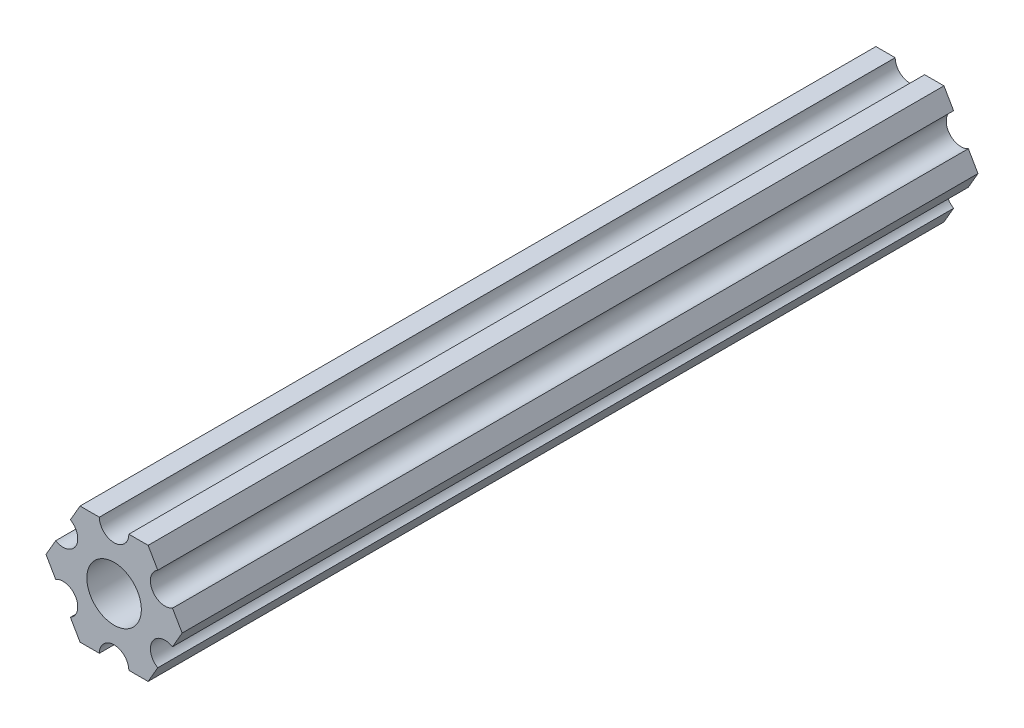
ISO-10303-21;
HEADER;
FILE_DESCRIPTION(('STEP AP214'),'2;1');
FILE_NAME('part.step','',(''),(''),'','','');
FILE_SCHEMA(('AUTOMOTIVE_DESIGN { 1 0 10303 214 1 1 1 1 }'));
ENDSEC;
DATA;
#1=APPLICATION_CONTEXT('core data for automotive mechanical design processes');
#2=APPLICATION_PROTOCOL_DEFINITION('international standard','automotive_design',2000,#1);
#3=PRODUCT_CONTEXT('',#1,'mechanical');
#4=PRODUCT('Part','Part','',(#3));
#5=PRODUCT_RELATED_PRODUCT_CATEGORY('part','',(#4));
#6=PRODUCT_DEFINITION_FORMATION('','',#4);
#7=PRODUCT_DEFINITION_CONTEXT('part definition',#1,'design');
#8=PRODUCT_DEFINITION('design','',#6,#7);
#9=PRODUCT_DEFINITION_SHAPE('','',#8);
#10=(LENGTH_UNIT() NAMED_UNIT(*) SI_UNIT(.MILLI.,.METRE.));
#11=(NAMED_UNIT(*) PLANE_ANGLE_UNIT() SI_UNIT($,.RADIAN.));
#12=(NAMED_UNIT(*) SI_UNIT($,.STERADIAN.) SOLID_ANGLE_UNIT());
#13=UNCERTAINTY_MEASURE_WITH_UNIT(LENGTH_MEASURE(1.E-05),#10,'distance_accuracy_value','');
#14=(GEOMETRIC_REPRESENTATION_CONTEXT(3) GLOBAL_UNCERTAINTY_ASSIGNED_CONTEXT((#13)) GLOBAL_UNIT_ASSIGNED_CONTEXT((#10,
#11,#12)) REPRESENTATION_CONTEXT('',''));
#15=CARTESIAN_POINT('',(0.,0.,0.));
#16=DIRECTION('',(0.,0.,1.));
#17=DIRECTION('',(1.,0.,0.));
#18=AXIS2_PLACEMENT_3D('',#15,#16,#17);
#19=CARTESIAN_POINT('',(6.29301142309098,-1.80018429024546,85.725));
#20=DIRECTION('',(-0.866025434075723,0.499999947533953,0.));
#21=DIRECTION('',(-0.499999947533953,-0.866025434075723,0.));
#22=AXIS2_PLACEMENT_3D('',#19,#20,#21);
#23=PLANE('',#22);
#24=DIRECTION('',(0.,0.,1.));
#25=VECTOR('',#24,1.);
#26=CARTESIAN_POINT('',(7.33234841870826,4.44212519169686E-07,85.725));
#27=LINE('',#26,#25);
#28=CARTESIAN_POINT('',(7.33234841870826,4.44212518961143E-07,0.));
#29=VERTEX_POINT('',#28);
#30=CARTESIAN_POINT('',(7.33234841870826,4.44212519315656E-07,85.725));
#31=VERTEX_POINT('',#30);
#32=EDGE_CURVE('E322',#29,#31,#27,.T.);
#33=ORIENTED_EDGE('',*,*,#32,.T.);
#34=DIRECTION('',(0.499999947533953,0.866025434075723,0.));
#35=VECTOR('',#34,1.);
#36=CARTESIAN_POINT('',(6.29301142309098,-1.80018429024546,85.725));
#37=LINE('',#36,#35);
#38=CARTESIAN_POINT('',(6.29301142309098,-1.80018429024546,85.725));
#39=VERTEX_POINT('',#38);
#40=EDGE_CURVE('E214',#39,#31,#37,.T.);
#41=ORIENTED_EDGE('',*,*,#40,.F.);
#42=DIRECTION('',(0.,0.,-1.));
#43=VECTOR('',#42,1.);
#44=CARTESIAN_POINT('',(6.29301142309098,-1.80018429024546,85.725));
#45=LINE('',#44,#43);
#46=CARTESIAN_POINT('',(6.29301142309098,-1.80018429024546,0.));
#47=VERTEX_POINT('',#46);
#48=EDGE_CURVE('E267',#39,#47,#45,.T.);
#49=ORIENTED_EDGE('',*,*,#48,.T.);
#50=DIRECTION('',(0.499999947533953,0.866025434075723,0.));
#51=VECTOR('',#50,1.);
#52=CARTESIAN_POINT('',(6.29301142309098,-1.80018429024546,0.));
#53=LINE('',#52,#51);
#54=EDGE_CURVE('E217',#47,#29,#53,.T.);
#55=ORIENTED_EDGE('',*,*,#54,.T.);
#56=EDGE_LOOP('',(#33,#41,#49,#55));
#57=FACE_BOUND('',#56,.T.);
#58=ADVANCED_FACE('F16',(#57),#23,.F.);
#59=CARTESIAN_POINT('',(7.33234841870826,4.44212519169686E-07,85.725));
#60=DIRECTION('',(-0.866025373493145,-0.500000052466056,0.));
#61=DIRECTION('',(0.500000052466056,-0.866025373493145,0.));
#62=AXIS2_PLACEMENT_3D('',#59,#60,#61);
#63=PLANE('',#62);
#64=DIRECTION('',(0.,0.,-1.));
#65=VECTOR('',#64,1.);
#66=CARTESIAN_POINT('',(6.29301120497139,1.80018505273895,85.725));
#67=LINE('',#66,#65);
#68=CARTESIAN_POINT('',(6.29301120497139,1.80018505273895,0.));
#69=VERTEX_POINT('',#68);
#70=CARTESIAN_POINT('',(6.29301120497139,1.80018505273895,85.725));
#71=VERTEX_POINT('',#70);
#72=EDGE_CURVE('E319',#69,#71,#67,.F.);
#73=ORIENTED_EDGE('',*,*,#72,.T.);
#74=DIRECTION('',(-0.500000052466056,0.866025373493145,0.));
#75=VECTOR('',#74,1.);
#76=CARTESIAN_POINT('',(7.33234841870826,4.44212519198905E-07,85.725));
#77=LINE('',#76,#75);
#78=EDGE_CURVE('E74',#31,#71,#77,.T.);
#79=ORIENTED_EDGE('',*,*,#78,.F.);
#80=ORIENTED_EDGE('',*,*,#32,.F.);
#81=DIRECTION('',(-0.500000052466056,0.866025373493145,0.));
#82=VECTOR('',#81,1.);
#83=CARTESIAN_POINT('',(7.33234841870826,4.44212519198905E-07,0.));
#84=LINE('',#83,#82);
#85=EDGE_CURVE('E263',#29,#69,#84,.T.);
#86=ORIENTED_EDGE('',*,*,#85,.T.);
#87=EDGE_LOOP('',(#73,#79,#80,#86));
#88=FACE_BOUND('',#87,.T.);
#89=ADVANCED_FACE('F380',(#88),#63,.F.);
#90=CARTESIAN_POINT('',(5.49926112168156,3.17500033315933,85.725));
#91=DIRECTION('',(0.,0.,-1.));
#92=DIRECTION('',(-1.,0.,0.));
#93=AXIS2_PLACEMENT_3D('',#90,#91,#92);
#94=CYLINDRICAL_SURFACE('',#93,1.5875);
#95=CARTESIAN_POINT('',(5.49926112168156,3.17500033315933,85.725));
#96=DIRECTION('',(0.,0.,-1.));
#97=DIRECTION('',(-1.,0.,0.));
#98=AXIS2_PLACEMENT_3D('',#95,#96,#97);
#99=CIRCLE('',#98,1.5875);
#100=CARTESIAN_POINT('',(4.70551103839172,4.54981561357972,85.725));
#101=VERTEX_POINT('',#100);
#102=EDGE_CURVE('E65',#71,#101,#99,.T.);
#103=ORIENTED_EDGE('',*,*,#102,.F.);
#104=ORIENTED_EDGE('',*,*,#72,.F.);
#105=CARTESIAN_POINT('',(5.49926112168156,3.17500033315933,0.));
#106=DIRECTION('',(0.,0.,-1.));
#107=DIRECTION('',(-1.,0.,0.));
#108=AXIS2_PLACEMENT_3D('',#105,#106,#107);
#109=CIRCLE('',#108,1.5875);
#110=CARTESIAN_POINT('',(4.70551103839172,4.54981561357972,0.));
#111=VERTEX_POINT('',#110);
#112=EDGE_CURVE('E19',#69,#111,#109,.T.);
#113=ORIENTED_EDGE('',*,*,#112,.T.);
#114=DIRECTION('',(0.,0.,1.));
#115=VECTOR('',#114,1.);
#116=CARTESIAN_POINT('',(4.70551103839172,4.54981561357972,85.725));
#117=LINE('',#116,#115);
#118=EDGE_CURVE('E316',#111,#101,#117,.T.);
#119=ORIENTED_EDGE('',*,*,#118,.T.);
#120=EDGE_LOOP('',(#103,#104,#113,#119));
#121=FACE_BOUND('',#120,.T.);
#122=ADVANCED_FACE('F378',(#121),#94,.F.);
#123=CARTESIAN_POINT('',(4.70551103839172,4.54981561357972,85.725));
#124=DIRECTION('',(-0.866025373493151,-0.500000052466046,0.));
#125=DIRECTION('',(0.500000052466046,-0.866025373493151,0.));
#126=AXIS2_PLACEMENT_3D('',#123,#124,#125);
#127=PLANE('',#126);
#128=DIRECTION('',(0.,0.,1.));
#129=VECTOR('',#128,1.);
#130=CARTESIAN_POINT('',(3.66617382465481,6.35000022210627,85.725));
#131=LINE('',#130,#129);
#132=CARTESIAN_POINT('',(3.66617382465481,6.35000022210627,0.));
#133=VERTEX_POINT('',#132);
#134=CARTESIAN_POINT('',(3.66617382465481,6.35000022210627,85.725));
#135=VERTEX_POINT('',#134);
#136=EDGE_CURVE('E312',#133,#135,#131,.T.);
#137=ORIENTED_EDGE('',*,*,#136,.T.);
#138=DIRECTION('',(-0.500000052466046,0.866025373493151,0.));
#139=VECTOR('',#138,1.);
#140=CARTESIAN_POINT('',(4.70551103839172,4.54981561357972,85.725));
#141=LINE('',#140,#139);
#142=EDGE_CURVE('E209',#101,#135,#141,.T.);
#143=ORIENTED_EDGE('',*,*,#142,.F.);
#144=ORIENTED_EDGE('',*,*,#118,.F.);
#145=DIRECTION('',(-0.500000052466046,0.866025373493151,0.));
#146=VECTOR('',#145,1.);
#147=CARTESIAN_POINT('',(4.70551103839172,4.54981561357972,0.));
#148=LINE('',#147,#146);
#149=EDGE_CURVE('E259',#111,#133,#148,.T.);
#150=ORIENTED_EDGE('',*,*,#149,.T.);
#151=EDGE_LOOP('',(#137,#143,#144,#150));
#152=FACE_BOUND('',#151,.T.);
#153=ADVANCED_FACE('F369',(#152),#127,.F.);
#154=CARTESIAN_POINT('',(3.66617382465481,6.35000022210627,85.725));
#155=DIRECTION('',(6.05825850611185E-08,-0.999999999999998,0.));
#156=DIRECTION('',(0.999999999999998,6.05825850611185E-08,0.));
#157=AXIS2_PLACEMENT_3D('',#154,#155,#156);
#158=PLANE('',#157);
#159=DIRECTION('',(0.,0.,-1.));
#160=VECTOR('',#159,1.);
#161=CARTESIAN_POINT('',(1.58749961530074,6.35000009617482,85.725));
#162=LINE('',#161,#160);
#163=CARTESIAN_POINT('',(1.58749961530073,6.35000015914054,0.));
#164=VERTEX_POINT('',#163);
#165=CARTESIAN_POINT('',(1.58749961530073,6.35000015914054,85.725));
#166=VERTEX_POINT('',#165);
#167=EDGE_CURVE('E309',#164,#166,#162,.F.);
#168=ORIENTED_EDGE('',*,*,#167,.T.);
#169=DIRECTION('',(1.,0.,0.));
#170=VECTOR('',#169,1.);
#171=CARTESIAN_POINT('',(5.49926112168156,6.35000022210627,85.725));
#172=LINE('',#171,#170);
#173=EDGE_CURVE('E174',#135,#166,#172,.F.);
#174=ORIENTED_EDGE('',*,*,#173,.F.);
#175=ORIENTED_EDGE('',*,*,#136,.F.);
#176=DIRECTION('',(1.,0.,0.));
#177=VECTOR('',#176,1.);
#178=CARTESIAN_POINT('',(5.49926112168156,6.35000022210627,0.));
#179=LINE('',#178,#177);
#180=EDGE_CURVE('E255',#133,#164,#179,.F.);
#181=ORIENTED_EDGE('',*,*,#180,.T.);
#182=EDGE_LOOP('',(#168,#174,#175,#181));
#183=FACE_BOUND('',#182,.T.);
#184=ADVANCED_FACE('F366',(#183),#158,.F.);
#185=CARTESIAN_POINT('',(-3.84699260060323E-07,6.35,85.725));
#186=DIRECTION('',(0.,0.,-1.));
#187=DIRECTION('',(-1.,0.,0.));
#188=AXIS2_PLACEMENT_3D('',#185,#186,#187);
#189=CYLINDRICAL_SURFACE('',#188,1.5875);
#190=DIRECTION('',(0.,0.,1.));
#191=VECTOR('',#190,1.);
#192=CARTESIAN_POINT('',(-1.58750038469926,6.34999990382518,85.725));
#193=LINE('',#192,#191);
#194=CARTESIAN_POINT('',(-1.58750038469926,6.34999990382518,0.));
#195=VERTEX_POINT('',#194);
#196=CARTESIAN_POINT('',(-1.58750038469926,6.34999990382518,85.725));
#197=VERTEX_POINT('',#196);
#198=EDGE_CURVE('E124',#195,#197,#193,.T.);
#199=ORIENTED_EDGE('',*,*,#198,.T.);
#200=CARTESIAN_POINT('',(-3.84699260060323E-07,6.35,85.725));
#201=DIRECTION('',(0.,0.,-1.));
#202=DIRECTION('',(-1.,0.,0.));
#203=AXIS2_PLACEMENT_3D('',#200,#201,#202);
#204=CIRCLE('',#203,1.5875);
#205=EDGE_CURVE('E179',#166,#197,#204,.T.);
#206=ORIENTED_EDGE('',*,*,#205,.F.);
#207=ORIENTED_EDGE('',*,*,#167,.F.);
#208=CARTESIAN_POINT('',(-3.84699260060323E-07,6.35,0.));
#209=DIRECTION('',(0.,0.,-1.));
#210=DIRECTION('',(-1.,0.,0.));
#211=AXIS2_PLACEMENT_3D('',#208,#209,#210);
#212=CIRCLE('',#211,1.5875);
#213=EDGE_CURVE('E254',#164,#195,#212,.T.);
#214=ORIENTED_EDGE('',*,*,#213,.T.);
#215=EDGE_LOOP('',(#199,#206,#207,#214));
#216=FACE_BOUND('',#215,.T.);
#217=ADVANCED_FACE('F360',(#216),#189,.F.);
#218=CARTESIAN_POINT('',(-1.58750038469926,6.34999990382518,85.725));
#219=DIRECTION('',(6.05825963273174E-08,-0.999999999999998,0.));
#220=DIRECTION('',(0.999999999999998,6.05825963273174E-08,0.));
#221=AXIS2_PLACEMENT_3D('',#218,#219,#220);
#222=PLANE('',#221);
#223=DIRECTION('',(0.,0.,1.));
#224=VECTOR('',#223,1.);
#225=CARTESIAN_POINT('',(-3.66617459405349,6.3499997778937,85.725));
#226=LINE('',#225,#224);
#227=CARTESIAN_POINT('',(-3.66617454558244,6.34999986184803,0.));
#228=VERTEX_POINT('',#227);
#229=CARTESIAN_POINT('',(-3.66617454558244,6.34999986184803,85.725));
#230=VERTEX_POINT('',#229);
#231=EDGE_CURVE('E135',#228,#230,#226,.T.);
#232=ORIENTED_EDGE('',*,*,#231,.T.);
#233=DIRECTION('',(1.,0.,0.));
#234=VECTOR('',#233,1.);
#235=CARTESIAN_POINT('',(5.49926112168156,6.34999990382518,85.725));
#236=LINE('',#235,#234);
#237=EDGE_CURVE('E182',#197,#230,#236,.F.);
#238=ORIENTED_EDGE('',*,*,#237,.F.);
#239=ORIENTED_EDGE('',*,*,#198,.F.);
#240=DIRECTION('',(1.,0.,0.));
#241=VECTOR('',#240,1.);
#242=CARTESIAN_POINT('',(5.49926112168156,6.34999990382518,0.));
#243=LINE('',#242,#241);
#244=EDGE_CURVE('E190',#195,#228,#243,.F.);
#245=ORIENTED_EDGE('',*,*,#244,.T.);
#246=EDGE_LOOP('',(#232,#238,#239,#245));
#247=FACE_BOUND('',#246,.T.);
#248=ADVANCED_FACE('F189',(#247),#222,.F.);
#249=CARTESIAN_POINT('',(-3.66617459405349,6.3499997778937,85.725));
#250=DIRECTION('',(0.866025434075729,-0.499999947533942,0.));
#251=DIRECTION('',(0.499999947533942,0.866025434075729,0.));
#252=AXIS2_PLACEMENT_3D('',#249,#250,#251);
#253=PLANE('',#252);
#254=DIRECTION('',(0.,0.,-1.));
#255=VECTOR('',#254,1.);
#256=CARTESIAN_POINT('',(-4.70551158967065,4.54981504343587,85.725));
#257=LINE('',#256,#255);
#258=CARTESIAN_POINT('',(-4.70551158967065,4.54981504343587,0.));
#259=VERTEX_POINT('',#258);
#260=CARTESIAN_POINT('',(-4.70551158967065,4.54981504343587,85.725));
#261=VERTEX_POINT('',#260);
#262=EDGE_CURVE('E192',#259,#261,#257,.F.);
#263=ORIENTED_EDGE('',*,*,#262,.T.);
#264=DIRECTION('',(-0.499999947533943,-0.866025434075729,0.));
#265=VECTOR('',#264,1.);
#266=CARTESIAN_POINT('',(-3.66617459405349,6.3499997778937,85.725));
#267=LINE('',#266,#265);
#268=EDGE_CURVE('E185',#230,#261,#267,.T.);
#269=ORIENTED_EDGE('',*,*,#268,.F.);
#270=ORIENTED_EDGE('',*,*,#231,.F.);
#271=DIRECTION('',(-0.499999947533943,-0.866025434075729,0.));
#272=VECTOR('',#271,1.);
#273=CARTESIAN_POINT('',(-3.66617459405349,6.3499997778937,0.));
#274=LINE('',#273,#272);
#275=EDGE_CURVE('E249',#228,#259,#274,.T.);
#276=ORIENTED_EDGE('',*,*,#275,.T.);
#277=EDGE_LOOP('',(#263,#269,#270,#276));
#278=FACE_BOUND('',#277,.T.);
#279=ADVANCED_FACE('F194',(#278),#253,.F.);
#280=CARTESIAN_POINT('',(-5.49926150638082,3.17499966684067,85.725));
#281=DIRECTION('',(0.,0.,-1.));
#282=DIRECTION('',(-1.,0.,0.));
#283=AXIS2_PLACEMENT_3D('',#280,#281,#282);
#284=CYLINDRICAL_SURFACE('',#283,1.5875);
#285=DIRECTION('',(0.,0.,1.));
#286=VECTOR('',#285,1.);
#287=CARTESIAN_POINT('',(-6.29301142309098,1.80018429024547,85.725));
#288=LINE('',#287,#286);
#289=CARTESIAN_POINT('',(-6.29301142309098,1.80018429024547,0.));
#290=VERTEX_POINT('',#289);
#291=CARTESIAN_POINT('',(-6.29301142309098,1.80018429024547,85.725));
#292=VERTEX_POINT('',#291);
#293=EDGE_CURVE('E301',#290,#292,#288,.T.);
#294=ORIENTED_EDGE('',*,*,#293,.T.);
#295=CARTESIAN_POINT('',(-5.49926150638082,3.17499966684067,85.725));
#296=DIRECTION('',(0.,0.,-1.));
#297=DIRECTION('',(-1.,0.,0.));
#298=AXIS2_PLACEMENT_3D('',#295,#296,#297);
#299=CIRCLE('',#298,1.5875);
#300=EDGE_CURVE('E197',#261,#292,#299,.T.);
#301=ORIENTED_EDGE('',*,*,#300,.F.);
#302=ORIENTED_EDGE('',*,*,#262,.F.);
#303=CARTESIAN_POINT('',(-5.49926150638082,3.17499966684067,0.));
#304=DIRECTION('',(0.,0.,-1.));
#305=DIRECTION('',(-1.,0.,0.));
#306=AXIS2_PLACEMENT_3D('',#303,#304,#305);
#307=CIRCLE('',#306,1.5875);
#308=EDGE_CURVE('E248',#259,#290,#307,.T.);
#309=ORIENTED_EDGE('',*,*,#308,.T.);
#310=EDGE_LOOP('',(#294,#301,#302,#309));
#311=FACE_BOUND('',#310,.T.);
#312=ADVANCED_FACE('F443',(#311),#284,.F.);
#313=CARTESIAN_POINT('',(-6.29301142309098,1.80018429024547,85.725));
#314=DIRECTION('',(0.866025434075724,-0.499999947533951,0.));
#315=DIRECTION('',(0.499999947533951,0.866025434075724,0.));
#316=AXIS2_PLACEMENT_3D('',#313,#314,#315);
#317=PLANE('',#316);
#318=DIRECTION('',(0.,0.,1.));
#319=VECTOR('',#318,1.);
#320=CARTESIAN_POINT('',(-7.33234841870826,-4.44212523790841E-07,85.725));
#321=LINE('',#320,#319);
#322=CARTESIAN_POINT('',(-7.33234841870826,-4.44212524036367E-07,0.));
#323=VERTEX_POINT('',#322);
#324=CARTESIAN_POINT('',(-7.33234841870826,-4.44212524036367E-07,85.725));
#325=VERTEX_POINT('',#324);
#326=EDGE_CURVE('E297',#323,#325,#321,.T.);
#327=ORIENTED_EDGE('',*,*,#326,.T.);
#328=DIRECTION('',(-0.499999947533952,-0.866025434075724,0.));
#329=VECTOR('',#328,1.);
#330=CARTESIAN_POINT('',(-6.29301142309098,1.80018429024547,85.725));
#331=LINE('',#330,#329);
#332=EDGE_CURVE('E202',#292,#325,#331,.T.);
#333=ORIENTED_EDGE('',*,*,#332,.F.);
#334=ORIENTED_EDGE('',*,*,#293,.F.);
#335=DIRECTION('',(-0.499999947533952,-0.866025434075724,0.));
#336=VECTOR('',#335,1.);
#337=CARTESIAN_POINT('',(-6.29301142309098,1.80018429024547,0.));
#338=LINE('',#337,#336);
#339=EDGE_CURVE('E244',#290,#323,#338,.T.);
#340=ORIENTED_EDGE('',*,*,#339,.T.);
#341=EDGE_LOOP('',(#327,#333,#334,#340));
#342=FACE_BOUND('',#341,.T.);
#343=ADVANCED_FACE('F407',(#342),#317,.F.);
#344=CARTESIAN_POINT('',(-7.33234841870826,-4.44212523790841E-07,85.725));
#345=DIRECTION('',(0.866025373493151,0.500000052466045,0.));
#346=DIRECTION('',(-0.500000052466045,0.866025373493151,0.));
#347=AXIS2_PLACEMENT_3D('',#344,#345,#346);
#348=PLANE('',#347);
#349=DIRECTION('',(0.,0.,-1.));
#350=VECTOR('',#349,1.);
#351=CARTESIAN_POINT('',(-6.29301120497141,-1.80018505273896,85.725));
#352=LINE('',#351,#350);
#353=CARTESIAN_POINT('',(-6.29301120497141,-1.80018505273896,0.));
#354=VERTEX_POINT('',#353);
#355=CARTESIAN_POINT('',(-6.29301120497141,-1.80018505273896,85.725));
#356=VERTEX_POINT('',#355);
#357=EDGE_CURVE('E293',#354,#356,#352,.F.);
#358=ORIENTED_EDGE('',*,*,#357,.T.);
#359=DIRECTION('',(0.500000052466045,-0.866025373493151,0.));
#360=VECTOR('',#359,1.);
#361=CARTESIAN_POINT('',(-7.33234841870826,-4.44212523969395E-07,85.725));
#362=LINE('',#361,#360);
#363=EDGE_CURVE('E339',#325,#356,#362,.T.);
#364=ORIENTED_EDGE('',*,*,#363,.F.);
#365=ORIENTED_EDGE('',*,*,#326,.F.);
#366=DIRECTION('',(0.500000052466045,-0.866025373493151,0.));
#367=VECTOR('',#366,1.);
#368=CARTESIAN_POINT('',(-7.33234841870826,-4.44212523969395E-07,0.));
#369=LINE('',#368,#367);
#370=EDGE_CURVE('E240',#323,#354,#369,.T.);
#371=ORIENTED_EDGE('',*,*,#370,.T.);
#372=EDGE_LOOP('',(#358,#364,#365,#371));
#373=FACE_BOUND('',#372,.T.);
#374=ADVANCED_FACE('F411',(#373),#348,.F.);
#375=CARTESIAN_POINT('',(-5.49926112168156,-3.17500033315934,85.725));
#376=DIRECTION('',(0.,0.,-1.));
#377=DIRECTION('',(-1.,0.,0.));
#378=AXIS2_PLACEMENT_3D('',#375,#376,#377);
#379=CYLINDRICAL_SURFACE('',#378,1.5875);
#380=DIRECTION('',(0.,0.,1.));
#381=VECTOR('',#380,1.);
#382=CARTESIAN_POINT('',(-4.70551103839172,-4.54981561357972,85.725));
#383=LINE('',#382,#381);
#384=CARTESIAN_POINT('',(-4.70551103839172,-4.54981561357972,0.));
#385=VERTEX_POINT('',#384);
#386=CARTESIAN_POINT('',(-4.70551103839172,-4.54981561357972,85.725));
#387=VERTEX_POINT('',#386);
#388=EDGE_CURVE('E289',#385,#387,#383,.T.);
#389=ORIENTED_EDGE('',*,*,#388,.T.);
#390=CARTESIAN_POINT('',(-5.49926112168156,-3.17500033315934,85.725));
#391=DIRECTION('',(0.,0.,-1.));
#392=DIRECTION('',(-1.,0.,0.));
#393=AXIS2_PLACEMENT_3D('',#390,#391,#392);
#394=CIRCLE('',#393,1.5875);
#395=EDGE_CURVE('E336',#356,#387,#394,.T.);
#396=ORIENTED_EDGE('',*,*,#395,.F.);
#397=ORIENTED_EDGE('',*,*,#357,.F.);
#398=CARTESIAN_POINT('',(-5.49926112168156,-3.17500033315934,0.));
#399=DIRECTION('',(0.,0.,-1.));
#400=DIRECTION('',(-1.,0.,0.));
#401=AXIS2_PLACEMENT_3D('',#398,#399,#400);
#402=CIRCLE('',#401,1.5875);
#403=EDGE_CURVE('E239',#354,#385,#402,.T.);
#404=ORIENTED_EDGE('',*,*,#403,.T.);
#405=EDGE_LOOP('',(#389,#396,#397,#404));
#406=FACE_BOUND('',#405,.T.);
#407=ADVANCED_FACE('F415',(#406),#379,.F.);
#408=CARTESIAN_POINT('',(-4.70551103839172,-4.54981561357972,85.725));
#409=DIRECTION('',(0.866025373493151,0.500000052466045,0.));
#410=DIRECTION('',(-0.500000052466045,0.866025373493151,0.));
#411=AXIS2_PLACEMENT_3D('',#408,#409,#410);
#412=PLANE('',#411);
#413=DIRECTION('',(0.,0.,1.));
#414=VECTOR('',#413,1.);
#415=CARTESIAN_POINT('',(-3.66617382465481,-6.35000022210628,85.725));
#416=LINE('',#415,#414);
#417=CARTESIAN_POINT('',(-3.6661738246548,-6.35000022210628,0.));
#418=VERTEX_POINT('',#417);
#419=CARTESIAN_POINT('',(-3.6661738246548,-6.35000022210628,85.725));
#420=VERTEX_POINT('',#419);
#421=EDGE_CURVE('E285',#418,#420,#416,.T.);
#422=ORIENTED_EDGE('',*,*,#421,.T.);
#423=DIRECTION('',(0.500000052466045,-0.866025373493151,0.));
#424=VECTOR('',#423,1.);
#425=CARTESIAN_POINT('',(-4.70551103839172,-4.54981561357972,85.725));
#426=LINE('',#425,#424);
#427=EDGE_CURVE('E338',#387,#420,#426,.T.);
#428=ORIENTED_EDGE('',*,*,#427,.F.);
#429=ORIENTED_EDGE('',*,*,#388,.F.);
#430=DIRECTION('',(0.500000052466045,-0.866025373493151,0.));
#431=VECTOR('',#430,1.);
#432=CARTESIAN_POINT('',(-4.70551103839172,-4.54981561357972,0.));
#433=LINE('',#432,#431);
#434=EDGE_CURVE('E235',#385,#418,#433,.T.);
#435=ORIENTED_EDGE('',*,*,#434,.T.);
#436=EDGE_LOOP('',(#422,#428,#429,#435));
#437=FACE_BOUND('',#436,.T.);
#438=ADVANCED_FACE('F421',(#437),#412,.F.);
#439=CARTESIAN_POINT('',(-3.66617382465481,-6.35000022210628,85.725));
#440=DIRECTION('',(-6.05825854783851E-08,0.999999999999998,0.));
#441=DIRECTION('',(-0.999999999999998,-6.05825854783851E-08,0.));
#442=AXIS2_PLACEMENT_3D('',#439,#440,#441);
#443=PLANE('',#442);
#444=DIRECTION('',(0.,0.,-1.));
#445=VECTOR('',#444,1.);
#446=CARTESIAN_POINT('',(-1.58749961530074,-6.35,85.725));
#447=LINE('',#446,#445);
#448=CARTESIAN_POINT('',(-1.58749961530073,-6.35000011105314,0.));
#449=VERTEX_POINT('',#448);
#450=CARTESIAN_POINT('',(-1.58749961530073,-6.35000011105314,85.725));
#451=VERTEX_POINT('',#450);
#452=EDGE_CURVE('E281',#449,#451,#447,.F.);
#453=ORIENTED_EDGE('',*,*,#452,.T.);
#454=DIRECTION('',(1.,0.,0.));
#455=VECTOR('',#454,1.);
#456=CARTESIAN_POINT('',(5.49926112168156,-6.35000022210628,85.725));
#457=LINE('',#456,#455);
#458=EDGE_CURVE('E335',#420,#451,#457,.T.);
#459=ORIENTED_EDGE('',*,*,#458,.F.);
#460=ORIENTED_EDGE('',*,*,#421,.F.);
#461=DIRECTION('',(1.,0.,0.));
#462=VECTOR('',#461,1.);
#463=CARTESIAN_POINT('',(5.49926112168156,-6.35000022210628,0.));
#464=LINE('',#463,#462);
#465=EDGE_CURVE('E231',#418,#449,#464,.T.);
#466=ORIENTED_EDGE('',*,*,#465,.T.);
#467=EDGE_LOOP('',(#453,#459,#460,#466));
#468=FACE_BOUND('',#467,.T.);
#469=ADVANCED_FACE('F425',(#468),#443,.F.);
#470=CARTESIAN_POINT('',(3.8469926204343E-07,-6.35,85.725));
#471=DIRECTION('',(0.,0.,-1.));
#472=DIRECTION('',(-1.,0.,0.));
#473=AXIS2_PLACEMENT_3D('',#470,#471,#472);
#474=CYLINDRICAL_SURFACE('',#473,1.5875);
#475=DIRECTION('',(0.,0.,1.));
#476=VECTOR('',#475,1.);
#477=CARTESIAN_POINT('',(1.58750038469926,-6.34999990382518,85.725));
#478=LINE('',#477,#476);
#479=CARTESIAN_POINT('',(1.58750038469926,-6.34999990382518,0.));
#480=VERTEX_POINT('',#479);
#481=CARTESIAN_POINT('',(1.58750038469926,-6.34999990382518,85.725));
#482=VERTEX_POINT('',#481);
#483=EDGE_CURVE('E277',#480,#482,#478,.T.);
#484=ORIENTED_EDGE('',*,*,#483,.T.);
#485=CARTESIAN_POINT('',(3.8469926204343E-07,-6.35,85.725));
#486=DIRECTION('',(0.,0.,-1.));
#487=DIRECTION('',(-1.,0.,0.));
#488=AXIS2_PLACEMENT_3D('',#485,#486,#487);
#489=CIRCLE('',#488,1.5875);
#490=EDGE_CURVE('E332',#451,#482,#489,.T.);
#491=ORIENTED_EDGE('',*,*,#490,.F.);
#492=ORIENTED_EDGE('',*,*,#452,.F.);
#493=CARTESIAN_POINT('',(3.8469926204343E-07,-6.35,0.));
#494=DIRECTION('',(0.,0.,-1.));
#495=DIRECTION('',(-1.,0.,0.));
#496=AXIS2_PLACEMENT_3D('',#493,#494,#495);
#497=CIRCLE('',#496,1.5875);
#498=EDGE_CURVE('E230',#449,#480,#497,.T.);
#499=ORIENTED_EDGE('',*,*,#498,.T.);
#500=EDGE_LOOP('',(#484,#491,#492,#499));
#501=FACE_BOUND('',#500,.T.);
#502=ADVANCED_FACE('F429',(#501),#474,.F.);
#503=CARTESIAN_POINT('',(1.58750038469926,-6.34999990382518,85.725));
#504=DIRECTION('',(-6.05825721258438E-08,0.999999999999998,0.));
#505=DIRECTION('',(-0.999999999999998,-6.05825721258438E-08,0.));
#506=AXIS2_PLACEMENT_3D('',#503,#504,#505);
#507=PLANE('',#506);
#508=DIRECTION('',(0.,0.,1.));
#509=VECTOR('',#508,1.);
#510=CARTESIAN_POINT('',(3.66617459405346,-6.34999977789375,85.725));
#511=LINE('',#510,#509);
#512=CARTESIAN_POINT('',(3.66617454558244,-6.34999986184804,0.));
#513=VERTEX_POINT('',#512);
#514=CARTESIAN_POINT('',(3.66617454558244,-6.34999986184804,85.725));
#515=VERTEX_POINT('',#514);
#516=EDGE_CURVE('E273',#513,#515,#511,.T.);
#517=ORIENTED_EDGE('',*,*,#516,.T.);
#518=DIRECTION('',(1.,0.,0.));
#519=VECTOR('',#518,1.);
#520=CARTESIAN_POINT('',(5.49926112168156,-6.34999990382518,85.725));
#521=LINE('',#520,#519);
#522=EDGE_CURVE('E334',#482,#515,#521,.T.);
#523=ORIENTED_EDGE('',*,*,#522,.F.);
#524=ORIENTED_EDGE('',*,*,#483,.F.);
#525=DIRECTION('',(1.,0.,0.));
#526=VECTOR('',#525,1.);
#527=CARTESIAN_POINT('',(5.49926112168156,-6.34999990382518,0.));
#528=LINE('',#527,#526);
#529=EDGE_CURVE('E226',#480,#513,#528,.T.);
#530=ORIENTED_EDGE('',*,*,#529,.T.);
#531=EDGE_LOOP('',(#517,#523,#524,#530));
#532=FACE_BOUND('',#531,.T.);
#533=ADVANCED_FACE('F432',(#532),#507,.F.);
#534=CARTESIAN_POINT('',(3.66617459405346,-6.34999977789375,85.725));
#535=DIRECTION('',(-0.86602543407573,0.499999947533941,0.));
#536=DIRECTION('',(-0.499999947533941,-0.86602543407573,0.));
#537=AXIS2_PLACEMENT_3D('',#534,#535,#536);
#538=PLANE('',#537);
#539=DIRECTION('',(0.,0.,1.));
#540=VECTOR('',#539,1.);
#541=CARTESIAN_POINT('',(4.70551158967065,-4.54981504343587,85.725));
#542=LINE('',#541,#540);
#543=CARTESIAN_POINT('',(4.70551158967065,-4.54981504343587,85.725));
#544=VERTEX_POINT('',#543);
#545=CARTESIAN_POINT('',(4.70551158967065,-4.54981504343587,0.));
#546=VERTEX_POINT('',#545);
#547=EDGE_CURVE('E270',#544,#546,#542,.F.);
#548=ORIENTED_EDGE('',*,*,#547,.F.);
#549=DIRECTION('',(0.49999994753394,0.86602543407573,0.));
#550=VECTOR('',#549,1.);
#551=CARTESIAN_POINT('',(3.66617459405346,-6.34999977789376,85.725));
#552=LINE('',#551,#550);
#553=EDGE_CURVE('E331',#515,#544,#552,.T.);
#554=ORIENTED_EDGE('',*,*,#553,.F.);
#555=ORIENTED_EDGE('',*,*,#516,.F.);
#556=DIRECTION('',(0.49999994753394,0.86602543407573,0.));
#557=VECTOR('',#556,1.);
#558=CARTESIAN_POINT('',(3.66617459405346,-6.34999977789376,0.));
#559=LINE('',#558,#557);
#560=EDGE_CURVE('E222',#513,#546,#559,.T.);
#561=ORIENTED_EDGE('',*,*,#560,.T.);
#562=EDGE_LOOP('',(#548,#554,#555,#561));
#563=FACE_BOUND('',#562,.T.);
#564=ADVANCED_FACE('F434',(#563),#538,.F.);
#565=CARTESIAN_POINT('',(5.49926150638082,-3.17499966684067,85.725));
#566=DIRECTION('',(0.,0.,-1.));
#567=DIRECTION('',(-1.,0.,0.));
#568=AXIS2_PLACEMENT_3D('',#565,#566,#567);
#569=CYLINDRICAL_SURFACE('',#568,1.58750000000001);
#570=CARTESIAN_POINT('',(5.49926150638082,-3.17499966684067,85.725));
#571=DIRECTION('',(0.,0.,-1.));
#572=DIRECTION('',(-1.,0.,0.));
#573=AXIS2_PLACEMENT_3D('',#570,#571,#572);
#574=CIRCLE('',#573,1.58750000000001);
#575=EDGE_CURVE('E39',#544,#39,#574,.T.);
#576=ORIENTED_EDGE('',*,*,#575,.F.);
#577=ORIENTED_EDGE('',*,*,#547,.T.);
#578=CARTESIAN_POINT('',(5.49926150638082,-3.17499966684067,0.));
#579=DIRECTION('',(0.,0.,-1.));
#580=DIRECTION('',(-1.,0.,0.));
#581=AXIS2_PLACEMENT_3D('',#578,#579,#580);
#582=CIRCLE('',#581,1.58750000000001);
#583=EDGE_CURVE('E221',#546,#47,#582,.T.);
#584=ORIENTED_EDGE('',*,*,#583,.T.);
#585=ORIENTED_EDGE('',*,*,#48,.F.);
#586=EDGE_LOOP('',(#576,#577,#584,#585));
#587=FACE_BOUND('',#586,.T.);
#588=ADVANCED_FACE('F384',(#587),#569,.F.);
#589=CARTESIAN_POINT('',(5.49926112168156,3.17500033315933,0.));
#590=DIRECTION('',(0.,0.,1.));
#591=DIRECTION('',(1.,0.,0.));
#592=AXIS2_PLACEMENT_3D('',#589,#590,#591);
#593=PLANE('',#592);
#594=CARTESIAN_POINT('',(0.,0.,0.));
#595=DIRECTION('',(0.,0.,-1.));
#596=DIRECTION('',(-1.,0.,0.));
#597=AXIS2_PLACEMENT_3D('',#594,#595,#596);
#598=CIRCLE('',#597,2.9337);
#599=CARTESIAN_POINT('',(-2.9337,0.,0.));
#600=VERTEX_POINT('',#599);
#601=EDGE_CURVE('E26',#600,#600,#598,.F.);
#602=ORIENTED_EDGE('',*,*,#601,.T.);
#603=EDGE_LOOP('',(#602));
#604=FACE_BOUND('',#603,.T.);
#605=ORIENTED_EDGE('',*,*,#583,.F.);
#606=ORIENTED_EDGE('',*,*,#560,.F.);
#607=ORIENTED_EDGE('',*,*,#529,.F.);
#608=ORIENTED_EDGE('',*,*,#498,.F.);
#609=ORIENTED_EDGE('',*,*,#465,.F.);
#610=ORIENTED_EDGE('',*,*,#434,.F.);
#611=ORIENTED_EDGE('',*,*,#403,.F.);
#612=ORIENTED_EDGE('',*,*,#370,.F.);
#613=ORIENTED_EDGE('',*,*,#339,.F.);
#614=ORIENTED_EDGE('',*,*,#308,.F.);
#615=ORIENTED_EDGE('',*,*,#275,.F.);
#616=ORIENTED_EDGE('',*,*,#244,.F.);
#617=ORIENTED_EDGE('',*,*,#213,.F.);
#618=ORIENTED_EDGE('',*,*,#180,.F.);
#619=ORIENTED_EDGE('',*,*,#149,.F.);
#620=ORIENTED_EDGE('',*,*,#112,.F.);
#621=ORIENTED_EDGE('',*,*,#85,.F.);
#622=ORIENTED_EDGE('',*,*,#54,.F.);
#623=EDGE_LOOP('',(#605,#606,#607,#608,#609,#610,#611,#612,#613,#614,#615,#616,#617,#618,#619,
#620,#621,#622));
#624=FACE_BOUND('',#623,.T.);
#625=ADVANCED_FACE('F363',(#604,#624),#593,.F.);
#626=CARTESIAN_POINT('',(5.49926112168156,3.17500033315933,85.725));
#627=DIRECTION('',(0.,0.,1.));
#628=DIRECTION('',(1.,0.,0.));
#629=AXIS2_PLACEMENT_3D('',#626,#627,#628);
#630=PLANE('',#629);
#631=CARTESIAN_POINT('',(0.,0.,85.725));
#632=DIRECTION('',(0.,0.,-1.));
#633=DIRECTION('',(-1.,0.,0.));
#634=AXIS2_PLACEMENT_3D('',#631,#632,#633);
#635=CIRCLE('',#634,2.9337);
#636=CARTESIAN_POINT('',(-2.9337,0.,85.725));
#637=VERTEX_POINT('',#636);
#638=EDGE_CURVE('E11',#637,#637,#635,.T.);
#639=ORIENTED_EDGE('',*,*,#638,.T.);
#640=EDGE_LOOP('',(#639));
#641=FACE_BOUND('',#640,.T.);
#642=ORIENTED_EDGE('',*,*,#553,.T.);
#643=ORIENTED_EDGE('',*,*,#575,.T.);
#644=ORIENTED_EDGE('',*,*,#40,.T.);
#645=ORIENTED_EDGE('',*,*,#78,.T.);
#646=ORIENTED_EDGE('',*,*,#102,.T.);
#647=ORIENTED_EDGE('',*,*,#142,.T.);
#648=ORIENTED_EDGE('',*,*,#173,.T.);
#649=ORIENTED_EDGE('',*,*,#205,.T.);
#650=ORIENTED_EDGE('',*,*,#237,.T.);
#651=ORIENTED_EDGE('',*,*,#268,.T.);
#652=ORIENTED_EDGE('',*,*,#300,.T.);
#653=ORIENTED_EDGE('',*,*,#332,.T.);
#654=ORIENTED_EDGE('',*,*,#363,.T.);
#655=ORIENTED_EDGE('',*,*,#395,.T.);
#656=ORIENTED_EDGE('',*,*,#427,.T.);
#657=ORIENTED_EDGE('',*,*,#458,.T.);
#658=ORIENTED_EDGE('',*,*,#490,.T.);
#659=ORIENTED_EDGE('',*,*,#522,.T.);
#660=EDGE_LOOP('',(#642,#643,#644,#645,#646,#647,#648,#649,#650,#651,#652,#653,#654,#655,#656,
#657,#658,#659));
#661=FACE_BOUND('',#660,.T.);
#662=ADVANCED_FACE('F184',(#641,#661),#630,.T.);
#663=CARTESIAN_POINT('',(0.,0.,85.725));
#664=DIRECTION('',(0.,0.,-1.));
#665=DIRECTION('',(-1.,0.,0.));
#666=AXIS2_PLACEMENT_3D('',#663,#664,#665);
#667=CYLINDRICAL_SURFACE('',#666,2.9337);
#668=ORIENTED_EDGE('',*,*,#601,.F.);
#669=EDGE_LOOP('',(#668));
#670=FACE_BOUND('',#669,.T.);
#671=ORIENTED_EDGE('',*,*,#638,.F.);
#672=EDGE_LOOP('',(#671));
#673=FACE_BOUND('',#672,.T.);
#674=ADVANCED_FACE('F453',(#670,#673),#667,.F.);
#675=CLOSED_SHELL('',(#58,#89,#122,#153,#184,#217,#248,#279,#312,#343,#374,#407,#438,#469,#502,
#533,#564,#588,#625,#662,#674));
#676=MANIFOLD_SOLID_BREP('B1',#675);
#677=ADVANCED_BREP_SHAPE_REPRESENTATION('',(#18,#676),#14);
#678=SHAPE_DEFINITION_REPRESENTATION(#9,#677);
ENDSEC;
END-ISO-10303-21;
